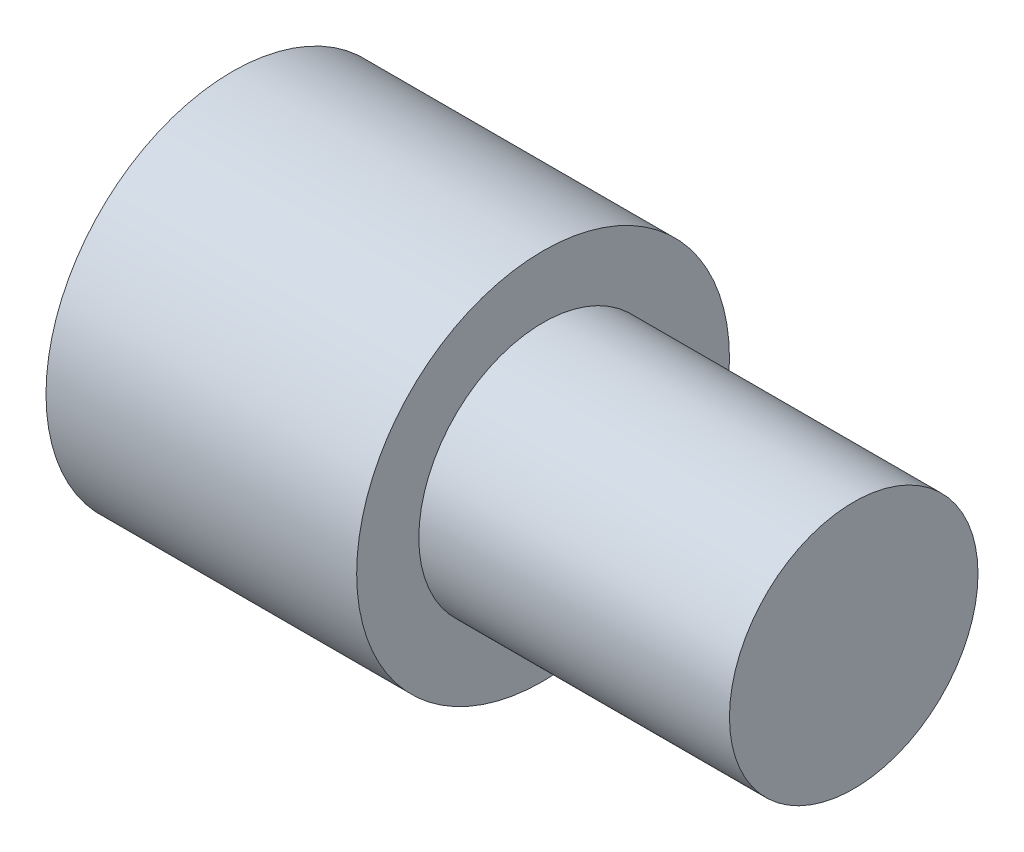
ISO-10303-21;
HEADER;
FILE_DESCRIPTION(('STEP AP214'),'2;1');
FILE_NAME('part.step','',(''),(''),'','','');
FILE_SCHEMA(('AUTOMOTIVE_DESIGN { 1 0 10303 214 1 1 1 1 }'));
ENDSEC;
DATA;
#1=APPLICATION_CONTEXT('core data for automotive mechanical design processes');
#2=APPLICATION_PROTOCOL_DEFINITION('international standard','automotive_design',2000,#1);
#3=PRODUCT_CONTEXT('',#1,'mechanical');
#4=PRODUCT('Part','Part','',(#3));
#5=PRODUCT_RELATED_PRODUCT_CATEGORY('part','',(#4));
#6=PRODUCT_DEFINITION_FORMATION('','',#4);
#7=PRODUCT_DEFINITION_CONTEXT('part definition',#1,'design');
#8=PRODUCT_DEFINITION('design','',#6,#7);
#9=PRODUCT_DEFINITION_SHAPE('','',#8);
#10=(LENGTH_UNIT() NAMED_UNIT(*) SI_UNIT(.MILLI.,.METRE.));
#11=(NAMED_UNIT(*) PLANE_ANGLE_UNIT() SI_UNIT($,.RADIAN.));
#12=(NAMED_UNIT(*) SI_UNIT($,.STERADIAN.) SOLID_ANGLE_UNIT());
#13=UNCERTAINTY_MEASURE_WITH_UNIT(LENGTH_MEASURE(1.E-05),#10,'distance_accuracy_value','');
#14=(GEOMETRIC_REPRESENTATION_CONTEXT(3) GLOBAL_UNCERTAINTY_ASSIGNED_CONTEXT((#13)) GLOBAL_UNIT_ASSIGNED_CONTEXT((#10,
#11,#12)) REPRESENTATION_CONTEXT('',''));
#15=CARTESIAN_POINT('',(0.,0.,0.));
#16=DIRECTION('',(0.,0.,1.));
#17=DIRECTION('',(1.,0.,0.));
#18=AXIS2_PLACEMENT_3D('',#15,#16,#17);
#19=CARTESIAN_POINT('',(10.,0.,0.));
#20=DIRECTION('',(-1.,0.,0.));
#21=DIRECTION('',(0.,0.,1.));
#22=AXIS2_PLACEMENT_3D('',#19,#20,#21);
#23=CYLINDRICAL_SURFACE('',#22,4.);
#24=CARTESIAN_POINT('',(10.,0.,0.));
#25=DIRECTION('',(1.,0.,0.));
#26=DIRECTION('',(0.,0.,-1.));
#27=AXIS2_PLACEMENT_3D('',#24,#25,#26);
#28=CIRCLE('',#27,4.);
#29=CARTESIAN_POINT('',(10.,0.,-4.));
#30=VERTEX_POINT('',#29);
#31=EDGE_CURVE('E10',#30,#30,#28,.T.);
#32=ORIENTED_EDGE('',*,*,#31,.F.);
#33=EDGE_LOOP('',(#32));
#34=FACE_BOUND('',#33,.T.);
#35=CARTESIAN_POINT('',(0.,0.,0.));
#36=DIRECTION('',(1.,0.,0.));
#37=DIRECTION('',(0.,0.,-1.));
#38=AXIS2_PLACEMENT_3D('',#35,#36,#37);
#39=CIRCLE('',#38,4.);
#40=CARTESIAN_POINT('',(0.,0.,-4.));
#41=VERTEX_POINT('',#40);
#42=EDGE_CURVE('E40',#41,#41,#39,.T.);
#43=ORIENTED_EDGE('',*,*,#42,.T.);
#44=EDGE_LOOP('',(#43));
#45=FACE_BOUND('',#44,.T.);
#46=ADVANCED_FACE('F37',(#34,#45),#23,.T.);
#47=CARTESIAN_POINT('',(10.,0.,0.));
#48=DIRECTION('',(1.,0.,0.));
#49=DIRECTION('',(0.,0.,-1.));
#50=AXIS2_PLACEMENT_3D('',#47,#48,#49);
#51=PLANE('',#50);
#52=ORIENTED_EDGE('',*,*,#31,.T.);
#53=EDGE_LOOP('',(#52));
#54=FACE_BOUND('',#53,.T.);
#55=ADVANCED_FACE('F64',(#54),#51,.T.);
#56=CARTESIAN_POINT('',(-10.,0.,0.));
#57=DIRECTION('',(1.,0.,0.));
#58=DIRECTION('',(0.,0.,-1.));
#59=AXIS2_PLACEMENT_3D('',#56,#57,#58);
#60=CYLINDRICAL_SURFACE('',#59,6.);
#61=CARTESIAN_POINT('',(-10.,0.,0.));
#62=DIRECTION('',(-1.,0.,0.));
#63=DIRECTION('',(0.,0.,1.));
#64=AXIS2_PLACEMENT_3D('',#61,#62,#63);
#65=CIRCLE('',#64,6.);
#66=CARTESIAN_POINT('',(-10.,0.,6.));
#67=VERTEX_POINT('',#66);
#68=EDGE_CURVE('E49',#67,#67,#65,.T.);
#69=ORIENTED_EDGE('',*,*,#68,.F.);
#70=EDGE_LOOP('',(#69));
#71=FACE_BOUND('',#70,.T.);
#72=CARTESIAN_POINT('',(0.,0.,0.));
#73=DIRECTION('',(-1.,0.,0.));
#74=DIRECTION('',(0.,0.,1.));
#75=AXIS2_PLACEMENT_3D('',#72,#73,#74);
#76=CIRCLE('',#75,6.);
#77=CARTESIAN_POINT('',(0.,0.,6.));
#78=VERTEX_POINT('',#77);
#79=EDGE_CURVE('E51',#78,#78,#76,.T.);
#80=ORIENTED_EDGE('',*,*,#79,.T.);
#81=EDGE_LOOP('',(#80));
#82=FACE_BOUND('',#81,.T.);
#83=ADVANCED_FACE('F61',(#71,#82),#60,.T.);
#84=CARTESIAN_POINT('',(-10.,0.,0.));
#85=DIRECTION('',(-1.,0.,0.));
#86=DIRECTION('',(0.,0.,1.));
#87=AXIS2_PLACEMENT_3D('',#84,#85,#86);
#88=PLANE('',#87);
#89=ORIENTED_EDGE('',*,*,#68,.T.);
#90=EDGE_LOOP('',(#89));
#91=FACE_BOUND('',#90,.T.);
#92=ADVANCED_FACE('F59',(#91),#88,.T.);
#93=CARTESIAN_POINT('',(0.,0.,0.));
#94=DIRECTION('',(-1.,0.,0.));
#95=DIRECTION('',(0.,0.,1.));
#96=AXIS2_PLACEMENT_3D('',#93,#94,#95);
#97=PLANE('',#96);
#98=ORIENTED_EDGE('',*,*,#42,.F.);
#99=EDGE_LOOP('',(#98));
#100=FACE_BOUND('',#99,.T.);
#101=ORIENTED_EDGE('',*,*,#79,.F.);
#102=EDGE_LOOP('',(#101));
#103=FACE_BOUND('',#102,.T.);
#104=ADVANCED_FACE('F68',(#100,#103),#97,.F.);
#105=CLOSED_SHELL('',(#46,#55,#83,#92,#104));
#106=MANIFOLD_SOLID_BREP('B2',#105);
#107=ADVANCED_BREP_SHAPE_REPRESENTATION('',(#18,#106),#14);
#108=SHAPE_DEFINITION_REPRESENTATION(#9,#107);
ENDSEC;
END-ISO-10303-21;
